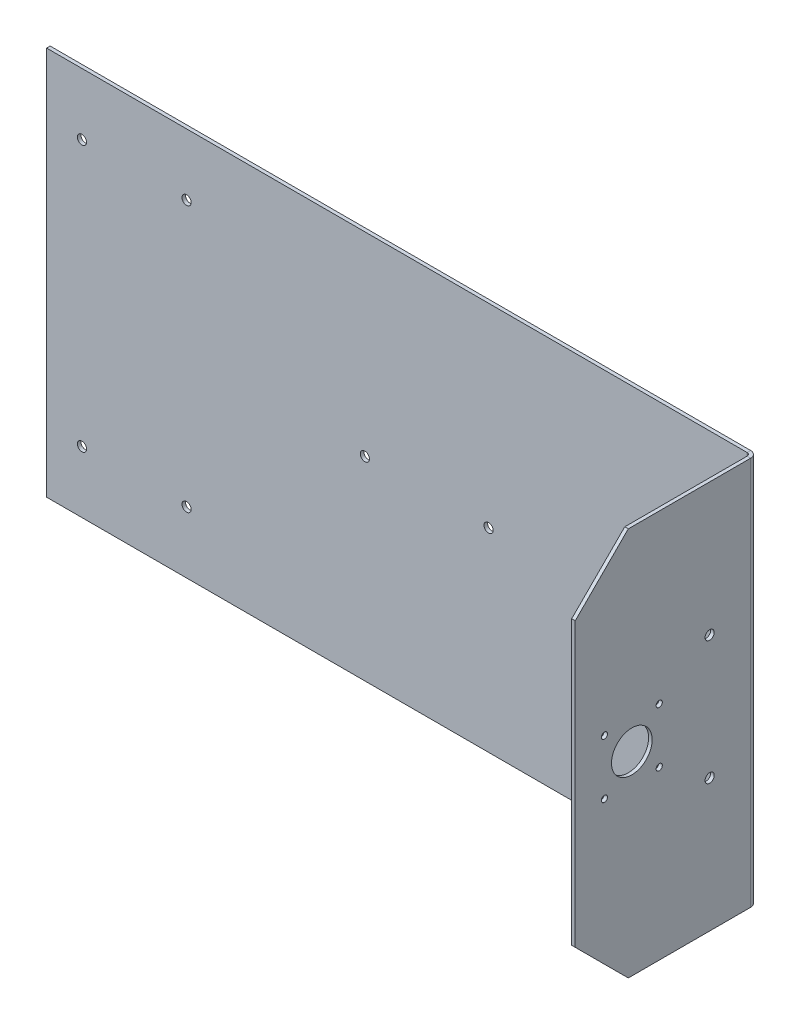
ISO-10303-21;
HEADER;
FILE_DESCRIPTION(('STEP AP214'),'2;1');
FILE_NAME('part.step','',(''),(''),'','','');
FILE_SCHEMA(('AUTOMOTIVE_DESIGN { 1 0 10303 214 1 1 1 1 }'));
ENDSEC;
DATA;
#1=APPLICATION_CONTEXT('core data for automotive mechanical design processes');
#2=APPLICATION_PROTOCOL_DEFINITION('international standard','automotive_design',2000,#1);
#3=PRODUCT_CONTEXT('',#1,'mechanical');
#4=PRODUCT('Part','Part','',(#3));
#5=PRODUCT_RELATED_PRODUCT_CATEGORY('part','',(#4));
#6=PRODUCT_DEFINITION_FORMATION('','',#4);
#7=PRODUCT_DEFINITION_CONTEXT('part definition',#1,'design');
#8=PRODUCT_DEFINITION('design','',#6,#7);
#9=PRODUCT_DEFINITION_SHAPE('','',#8);
#10=(LENGTH_UNIT() NAMED_UNIT(*) SI_UNIT(.MILLI.,.METRE.));
#11=(NAMED_UNIT(*) PLANE_ANGLE_UNIT() SI_UNIT($,.RADIAN.));
#12=(NAMED_UNIT(*) SI_UNIT($,.STERADIAN.) SOLID_ANGLE_UNIT());
#13=UNCERTAINTY_MEASURE_WITH_UNIT(LENGTH_MEASURE(1.E-05),#10,'distance_accuracy_value','');
#14=(GEOMETRIC_REPRESENTATION_CONTEXT(3) GLOBAL_UNCERTAINTY_ASSIGNED_CONTEXT((#13)) GLOBAL_UNIT_ASSIGNED_CONTEXT((#10,
#11,#12)) REPRESENTATION_CONTEXT('',''));
#15=CARTESIAN_POINT('',(0.,0.,0.));
#16=DIRECTION('',(0.,0.,1.));
#17=DIRECTION('',(1.,0.,0.));
#18=AXIS2_PLACEMENT_3D('',#15,#16,#17);
#19=CARTESIAN_POINT('',(200.,110.,3.));
#20=DIRECTION('',(0.,1.,0.));
#21=DIRECTION('',(0.,0.,-1.));
#22=AXIS2_PLACEMENT_3D('',#19,#20,#21);
#23=PLANE('',#22);
#24=DIRECTION('',(0.,0.,1.));
#25=VECTOR('',#24,1.);
#26=CARTESIAN_POINT('',(198.,110.,3.));
#27=LINE('',#26,#25);
#28=CARTESIAN_POINT('',(198.,110.,73.));
#29=VERTEX_POINT('',#28);
#30=CARTESIAN_POINT('',(198.,110.,3.8));
#31=VERTEX_POINT('',#30);
#32=EDGE_CURVE('E209',#29,#31,#27,.F.);
#33=ORIENTED_EDGE('',*,*,#32,.F.);
#34=DIRECTION('',(1.,0.,0.));
#35=VECTOR('',#34,1.);
#36=CARTESIAN_POINT('',(200.,110.,73.));
#37=LINE('',#36,#35);
#38=CARTESIAN_POINT('',(200.,110.,73.));
#39=VERTEX_POINT('',#38);
#40=EDGE_CURVE('E236',#29,#39,#37,.T.);
#41=ORIENTED_EDGE('',*,*,#40,.T.);
#42=DIRECTION('',(0.,0.,-1.));
#43=VECTOR('',#42,1.);
#44=CARTESIAN_POINT('',(200.,110.,3.));
#45=LINE('',#44,#43);
#46=CARTESIAN_POINT('',(200.,110.,3.8));
#47=VERTEX_POINT('',#46);
#48=EDGE_CURVE('E278',#39,#47,#45,.T.);
#49=ORIENTED_EDGE('',*,*,#48,.T.);
#50=DIRECTION('',(1.,0.,0.));
#51=VECTOR('',#50,1.);
#52=CARTESIAN_POINT('',(200.,110.,3.8));
#53=LINE('',#52,#51);
#54=EDGE_CURVE('E233',#31,#47,#53,.T.);
#55=ORIENTED_EDGE('',*,*,#54,.F.);
#56=EDGE_LOOP('',(#33,#41,#49,#55));
#57=FACE_BOUND('',#56,.T.);
#58=ADVANCED_FACE('F45',(#57),#23,.T.);
#59=CARTESIAN_POINT('',(200.,-110.,103.));
#60=DIRECTION('',(0.,0.,1.));
#61=DIRECTION('',(0.,1.,0.));
#62=AXIS2_PLACEMENT_3D('',#59,#60,#61);
#63=PLANE('',#62);
#64=DIRECTION('',(0.,1.,0.));
#65=VECTOR('',#64,1.);
#66=CARTESIAN_POINT('',(200.,-110.,103.));
#67=LINE('',#66,#65);
#68=CARTESIAN_POINT('',(200.,-80.0000000000001,103.));
#69=VERTEX_POINT('',#68);
#70=CARTESIAN_POINT('',(200.,79.9999999999999,103.));
#71=VERTEX_POINT('',#70);
#72=EDGE_CURVE('E280',#69,#71,#67,.T.);
#73=ORIENTED_EDGE('',*,*,#72,.T.);
#74=DIRECTION('',(-1.,0.,0.));
#75=VECTOR('',#74,1.);
#76=CARTESIAN_POINT('',(200.,79.9999999999999,103.));
#77=LINE('',#76,#75);
#78=CARTESIAN_POINT('',(198.,79.9999999999999,103.));
#79=VERTEX_POINT('',#78);
#80=EDGE_CURVE('E69',#71,#79,#77,.T.);
#81=ORIENTED_EDGE('',*,*,#80,.T.);
#82=DIRECTION('',(0.,1.,0.));
#83=VECTOR('',#82,1.);
#84=CARTESIAN_POINT('',(198.,-110.,103.));
#85=LINE('',#84,#83);
#86=CARTESIAN_POINT('',(198.,-80.0000000000001,103.));
#87=VERTEX_POINT('',#86);
#88=EDGE_CURVE('E207',#87,#79,#85,.T.);
#89=ORIENTED_EDGE('',*,*,#88,.F.);
#90=DIRECTION('',(1.,0.,0.));
#91=VECTOR('',#90,1.);
#92=CARTESIAN_POINT('',(200.,-80.0000000000001,103.));
#93=LINE('',#92,#91);
#94=EDGE_CURVE('E244',#87,#69,#93,.T.);
#95=ORIENTED_EDGE('',*,*,#94,.T.);
#96=EDGE_LOOP('',(#73,#81,#89,#95));
#97=FACE_BOUND('',#96,.T.);
#98=ADVANCED_FACE('F325',(#97),#63,.T.);
#99=CARTESIAN_POINT('',(200.,-110.,3.));
#100=DIRECTION('',(0.,1.,0.));
#101=DIRECTION('',(0.,0.,-1.));
#102=AXIS2_PLACEMENT_3D('',#99,#100,#101);
#103=PLANE('',#102);
#104=DIRECTION('',(0.,0.,-1.));
#105=VECTOR('',#104,1.);
#106=CARTESIAN_POINT('',(200.,-110.,3.));
#107=LINE('',#106,#105);
#108=CARTESIAN_POINT('',(200.,-110.,73.));
#109=VERTEX_POINT('',#108);
#110=CARTESIAN_POINT('',(200.,-110.,3.8));
#111=VERTEX_POINT('',#110);
#112=EDGE_CURVE('E282',#109,#111,#107,.T.);
#113=ORIENTED_EDGE('',*,*,#112,.F.);
#114=DIRECTION('',(1.,0.,0.));
#115=VECTOR('',#114,1.);
#116=CARTESIAN_POINT('',(200.,-110.,73.));
#117=LINE('',#116,#115);
#118=CARTESIAN_POINT('',(198.,-110.,73.));
#119=VERTEX_POINT('',#118);
#120=EDGE_CURVE('E11',#109,#119,#117,.F.);
#121=ORIENTED_EDGE('',*,*,#120,.T.);
#122=DIRECTION('',(0.,0.,1.));
#123=VECTOR('',#122,1.);
#124=CARTESIAN_POINT('',(198.,-110.,3.));
#125=LINE('',#124,#123);
#126=CARTESIAN_POINT('',(198.,-110.,3.8));
#127=VERTEX_POINT('',#126);
#128=EDGE_CURVE('E178',#119,#127,#125,.F.);
#129=ORIENTED_EDGE('',*,*,#128,.T.);
#130=DIRECTION('',(1.,0.,0.));
#131=VECTOR('',#130,1.);
#132=CARTESIAN_POINT('',(200.,-110.,3.8));
#133=LINE('',#132,#131);
#134=EDGE_CURVE('E230',#127,#111,#133,.T.);
#135=ORIENTED_EDGE('',*,*,#134,.T.);
#136=EDGE_LOOP('',(#113,#121,#129,#135));
#137=FACE_BOUND('',#136,.T.);
#138=ADVANCED_FACE('F331',(#137),#103,.F.);
#139=CARTESIAN_POINT('',(196.2,-110.,3.8));
#140=DIRECTION('',(0.,-1.,0.));
#141=DIRECTION('',(1.,0.,0.));
#142=AXIS2_PLACEMENT_3D('',#139,#140,#141);
#143=PLANE('',#142);
#144=ORIENTED_EDGE('',*,*,#134,.F.);
#145=CARTESIAN_POINT('',(196.2,-110.,3.8));
#146=DIRECTION('',(0.,1.,0.));
#147=DIRECTION('',(0.,0.,1.));
#148=AXIS2_PLACEMENT_3D('',#145,#146,#147);
#149=CIRCLE('',#148,1.8);
#150=CARTESIAN_POINT('',(196.2,-110.,2.));
#151=VERTEX_POINT('',#150);
#152=EDGE_CURVE('E201',#127,#151,#149,.T.);
#153=ORIENTED_EDGE('',*,*,#152,.T.);
#154=DIRECTION('',(0.,0.,-1.));
#155=VECTOR('',#154,1.);
#156=CARTESIAN_POINT('',(196.2,-110.,0.));
#157=LINE('',#156,#155);
#158=CARTESIAN_POINT('',(196.2,-110.,0.));
#159=VERTEX_POINT('',#158);
#160=EDGE_CURVE('E228',#151,#159,#157,.T.);
#161=ORIENTED_EDGE('',*,*,#160,.T.);
#162=CARTESIAN_POINT('',(196.2,-110.,3.8));
#163=DIRECTION('',(0.,1.,0.));
#164=DIRECTION('',(-1.,0.,0.));
#165=AXIS2_PLACEMENT_3D('',#162,#163,#164);
#166=CIRCLE('',#165,3.8);
#167=EDGE_CURVE('E163',#111,#159,#166,.T.);
#168=ORIENTED_EDGE('',*,*,#167,.F.);
#169=EDGE_LOOP('',(#144,#153,#161,#168));
#170=FACE_BOUND('',#169,.T.);
#171=ADVANCED_FACE('F387',(#170),#143,.T.);
#172=CARTESIAN_POINT('',(200.,-110.,0.));
#173=DIRECTION('',(0.,-1.,0.));
#174=DIRECTION('',(1.,0.,0.));
#175=AXIS2_PLACEMENT_3D('',#172,#173,#174);
#176=PLANE('',#175);
#177=ORIENTED_EDGE('',*,*,#160,.F.);
#178=DIRECTION('',(1.,0.,0.));
#179=VECTOR('',#178,1.);
#180=CARTESIAN_POINT('',(0.,-110.,2.));
#181=LINE('',#180,#179);
#182=CARTESIAN_POINT('',(-200.,-110.,2.));
#183=VERTEX_POINT('',#182);
#184=EDGE_CURVE('E173',#183,#151,#181,.T.);
#185=ORIENTED_EDGE('',*,*,#184,.F.);
#186=DIRECTION('',(0.,0.,-1.));
#187=VECTOR('',#186,1.);
#188=CARTESIAN_POINT('',(-200.,-110.,0.));
#189=LINE('',#188,#187);
#190=CARTESIAN_POINT('',(-200.,-110.,0.));
#191=VERTEX_POINT('',#190);
#192=EDGE_CURVE('E137',#183,#191,#189,.T.);
#193=ORIENTED_EDGE('',*,*,#192,.T.);
#194=DIRECTION('',(1.,0.,0.));
#195=VECTOR('',#194,1.);
#196=CARTESIAN_POINT('',(200.,-110.,0.));
#197=LINE('',#196,#195);
#198=EDGE_CURVE('E147',#191,#159,#197,.T.);
#199=ORIENTED_EDGE('',*,*,#198,.T.);
#200=EDGE_LOOP('',(#177,#185,#193,#199));
#201=FACE_BOUND('',#200,.T.);
#202=ADVANCED_FACE('F396',(#201),#176,.T.);
#203=CARTESIAN_POINT('',(-200.,-110.,0.));
#204=DIRECTION('',(-1.,0.,0.));
#205=DIRECTION('',(0.,-1.,0.));
#206=AXIS2_PLACEMENT_3D('',#203,#204,#205);
#207=PLANE('',#206);
#208=ORIENTED_EDGE('',*,*,#192,.F.);
#209=DIRECTION('',(0.,1.,0.));
#210=VECTOR('',#209,1.);
#211=CARTESIAN_POINT('',(-200.,0.,2.));
#212=LINE('',#211,#210);
#213=CARTESIAN_POINT('',(-200.,110.,2.));
#214=VERTEX_POINT('',#213);
#215=EDGE_CURVE('E132',#214,#183,#212,.F.);
#216=ORIENTED_EDGE('',*,*,#215,.F.);
#217=DIRECTION('',(0.,0.,-1.));
#218=VECTOR('',#217,1.);
#219=CARTESIAN_POINT('',(-200.,110.,0.));
#220=LINE('',#219,#218);
#221=CARTESIAN_POINT('',(-200.,110.,0.));
#222=VERTEX_POINT('',#221);
#223=EDGE_CURVE('E126',#214,#222,#220,.T.);
#224=ORIENTED_EDGE('',*,*,#223,.T.);
#225=DIRECTION('',(0.,-1.,0.));
#226=VECTOR('',#225,1.);
#227=CARTESIAN_POINT('',(-200.,-110.,0.));
#228=LINE('',#227,#226);
#229=EDGE_CURVE('E129',#222,#191,#228,.T.);
#230=ORIENTED_EDGE('',*,*,#229,.T.);
#231=EDGE_LOOP('',(#208,#216,#224,#230));
#232=FACE_BOUND('',#231,.T.);
#233=ADVANCED_FACE('F128',(#232),#207,.T.);
#234=CARTESIAN_POINT('',(200.,110.,0.));
#235=DIRECTION('',(0.,1.,0.));
#236=DIRECTION('',(-1.,0.,0.));
#237=AXIS2_PLACEMENT_3D('',#234,#235,#236);
#238=PLANE('',#237);
#239=ORIENTED_EDGE('',*,*,#223,.F.);
#240=DIRECTION('',(1.,0.,0.));
#241=VECTOR('',#240,1.);
#242=CARTESIAN_POINT('',(0.,110.,2.));
#243=LINE('',#242,#241);
#244=CARTESIAN_POINT('',(196.2,110.,2.));
#245=VERTEX_POINT('',#244);
#246=EDGE_CURVE('E196',#245,#214,#243,.F.);
#247=ORIENTED_EDGE('',*,*,#246,.F.);
#248=DIRECTION('',(0.,0.,-1.));
#249=VECTOR('',#248,1.);
#250=CARTESIAN_POINT('',(196.2,110.,0.));
#251=LINE('',#250,#249);
#252=CARTESIAN_POINT('',(196.2,110.,0.));
#253=VERTEX_POINT('',#252);
#254=EDGE_CURVE('E138',#245,#253,#251,.T.);
#255=ORIENTED_EDGE('',*,*,#254,.T.);
#256=DIRECTION('',(-1.,0.,0.));
#257=VECTOR('',#256,1.);
#258=CARTESIAN_POINT('',(200.,110.,0.));
#259=LINE('',#258,#257);
#260=EDGE_CURVE('E144',#253,#222,#259,.T.);
#261=ORIENTED_EDGE('',*,*,#260,.T.);
#262=EDGE_LOOP('',(#239,#247,#255,#261));
#263=FACE_BOUND('',#262,.T.);
#264=ADVANCED_FACE('F150',(#263),#238,.T.);
#265=CARTESIAN_POINT('',(200.,15.5,86.5));
#266=DIRECTION('',(-1.,0.,0.));
#267=DIRECTION('',(0.,0.,1.));
#268=AXIS2_PLACEMENT_3D('',#265,#266,#267);
#269=CYLINDRICAL_SURFACE('',#268,1.75);
#270=CARTESIAN_POINT('',(200.,15.5,86.5));
#271=DIRECTION('',(1.,0.,0.));
#272=DIRECTION('',(0.,1.,0.));
#273=AXIS2_PLACEMENT_3D('',#270,#271,#272);
#274=CIRCLE('',#273,1.75);
#275=CARTESIAN_POINT('',(200.,17.25,86.5));
#276=VERTEX_POINT('',#275);
#277=EDGE_CURVE('E167',#276,#276,#274,.T.);
#278=ORIENTED_EDGE('',*,*,#277,.T.);
#279=EDGE_LOOP('',(#278));
#280=FACE_BOUND('',#279,.T.);
#281=CARTESIAN_POINT('',(198.,15.5,86.5));
#282=DIRECTION('',(1.,0.,0.));
#283=DIRECTION('',(0.,1.,0.));
#284=AXIS2_PLACEMENT_3D('',#281,#282,#283);
#285=CIRCLE('',#284,1.75);
#286=CARTESIAN_POINT('',(198.,17.25,86.5));
#287=VERTEX_POINT('',#286);
#288=EDGE_CURVE('E204',#287,#287,#285,.T.);
#289=ORIENTED_EDGE('',*,*,#288,.F.);
#290=EDGE_LOOP('',(#289));
#291=FACE_BOUND('',#290,.T.);
#292=ADVANCED_FACE('F336',(#280,#291),#269,.F.);
#293=CARTESIAN_POINT('',(200.,-15.5,86.5));
#294=DIRECTION('',(-1.,0.,0.));
#295=DIRECTION('',(0.,0.,1.));
#296=AXIS2_PLACEMENT_3D('',#293,#294,#295);
#297=CYLINDRICAL_SURFACE('',#296,1.75);
#298=CARTESIAN_POINT('',(200.,-15.5,86.5));
#299=DIRECTION('',(1.,0.,0.));
#300=DIRECTION('',(0.,1.,0.));
#301=AXIS2_PLACEMENT_3D('',#298,#299,#300);
#302=CIRCLE('',#301,1.75);
#303=CARTESIAN_POINT('',(200.,-13.75,86.5));
#304=VERTEX_POINT('',#303);
#305=EDGE_CURVE('E266',#304,#304,#302,.T.);
#306=ORIENTED_EDGE('',*,*,#305,.T.);
#307=EDGE_LOOP('',(#306));
#308=FACE_BOUND('',#307,.T.);
#309=CARTESIAN_POINT('',(198.,-15.5,86.5));
#310=DIRECTION('',(1.,0.,0.));
#311=DIRECTION('',(0.,1.,0.));
#312=AXIS2_PLACEMENT_3D('',#309,#310,#311);
#313=CIRCLE('',#312,1.75);
#314=CARTESIAN_POINT('',(198.,-13.75,86.5));
#315=VERTEX_POINT('',#314);
#316=EDGE_CURVE('E216',#315,#315,#313,.T.);
#317=ORIENTED_EDGE('',*,*,#316,.F.);
#318=EDGE_LOOP('',(#317));
#319=FACE_BOUND('',#318,.T.);
#320=ADVANCED_FACE('F339',(#308,#319),#297,.F.);
#321=CARTESIAN_POINT('',(200.,-15.5,55.5));
#322=DIRECTION('',(-1.,0.,0.));
#323=DIRECTION('',(0.,0.,1.));
#324=AXIS2_PLACEMENT_3D('',#321,#322,#323);
#325=CYLINDRICAL_SURFACE('',#324,1.75);
#326=CARTESIAN_POINT('',(200.,-15.5,55.5));
#327=DIRECTION('',(1.,0.,0.));
#328=DIRECTION('',(0.,1.,0.));
#329=AXIS2_PLACEMENT_3D('',#326,#327,#328);
#330=CIRCLE('',#329,1.75);
#331=CARTESIAN_POINT('',(200.,-13.75,55.5));
#332=VERTEX_POINT('',#331);
#333=EDGE_CURVE('E269',#332,#332,#330,.T.);
#334=ORIENTED_EDGE('',*,*,#333,.T.);
#335=EDGE_LOOP('',(#334));
#336=FACE_BOUND('',#335,.T.);
#337=CARTESIAN_POINT('',(198.,-15.5,55.5));
#338=DIRECTION('',(1.,0.,0.));
#339=DIRECTION('',(0.,1.,0.));
#340=AXIS2_PLACEMENT_3D('',#337,#338,#339);
#341=CIRCLE('',#340,1.75);
#342=CARTESIAN_POINT('',(198.,-13.75,55.5));
#343=VERTEX_POINT('',#342);
#344=EDGE_CURVE('E219',#343,#343,#341,.T.);
#345=ORIENTED_EDGE('',*,*,#344,.F.);
#346=EDGE_LOOP('',(#345));
#347=FACE_BOUND('',#346,.T.);
#348=ADVANCED_FACE('F343',(#336,#347),#325,.F.);
#349=CARTESIAN_POINT('',(200.,15.5,55.5));
#350=DIRECTION('',(-1.,0.,0.));
#351=DIRECTION('',(0.,0.,1.));
#352=AXIS2_PLACEMENT_3D('',#349,#350,#351);
#353=CYLINDRICAL_SURFACE('',#352,1.75);
#354=CARTESIAN_POINT('',(200.,15.5,55.5));
#355=DIRECTION('',(1.,0.,0.));
#356=DIRECTION('',(0.,1.,0.));
#357=AXIS2_PLACEMENT_3D('',#354,#355,#356);
#358=CIRCLE('',#357,1.75);
#359=CARTESIAN_POINT('',(200.,17.25,55.5));
#360=VERTEX_POINT('',#359);
#361=EDGE_CURVE('E272',#360,#360,#358,.T.);
#362=ORIENTED_EDGE('',*,*,#361,.T.);
#363=EDGE_LOOP('',(#362));
#364=FACE_BOUND('',#363,.T.);
#365=CARTESIAN_POINT('',(198.,15.5,55.5));
#366=DIRECTION('',(1.,0.,0.));
#367=DIRECTION('',(0.,1.,0.));
#368=AXIS2_PLACEMENT_3D('',#365,#366,#367);
#369=CIRCLE('',#368,1.75);
#370=CARTESIAN_POINT('',(198.,17.25,55.5));
#371=VERTEX_POINT('',#370);
#372=EDGE_CURVE('E222',#371,#371,#369,.T.);
#373=ORIENTED_EDGE('',*,*,#372,.F.);
#374=EDGE_LOOP('',(#373));
#375=FACE_BOUND('',#374,.T.);
#376=ADVANCED_FACE('F347',(#364,#375),#353,.F.);
#377=CARTESIAN_POINT('',(200.,0.,71.));
#378=DIRECTION('',(-1.,0.,0.));
#379=DIRECTION('',(0.,0.,1.));
#380=AXIS2_PLACEMENT_3D('',#377,#378,#379);
#381=CYLINDRICAL_SURFACE('',#380,11.5);
#382=CARTESIAN_POINT('',(200.,0.,71.));
#383=DIRECTION('',(1.,0.,0.));
#384=DIRECTION('',(0.,1.,0.));
#385=AXIS2_PLACEMENT_3D('',#382,#383,#384);
#386=CIRCLE('',#385,11.5);
#387=CARTESIAN_POINT('',(200.,11.5,71.));
#388=VERTEX_POINT('',#387);
#389=EDGE_CURVE('E275',#388,#388,#386,.T.);
#390=ORIENTED_EDGE('',*,*,#389,.T.);
#391=EDGE_LOOP('',(#390));
#392=FACE_BOUND('',#391,.T.);
#393=CARTESIAN_POINT('',(198.,0.,71.));
#394=DIRECTION('',(1.,0.,0.));
#395=DIRECTION('',(0.,1.,0.));
#396=AXIS2_PLACEMENT_3D('',#393,#394,#395);
#397=CIRCLE('',#396,11.5);
#398=CARTESIAN_POINT('',(198.,11.5,71.));
#399=VERTEX_POINT('',#398);
#400=EDGE_CURVE('E211',#399,#399,#397,.T.);
#401=ORIENTED_EDGE('',*,*,#400,.F.);
#402=EDGE_LOOP('',(#401));
#403=FACE_BOUND('',#402,.T.);
#404=ADVANCED_FACE('F351',(#392,#403),#381,.F.);
#405=CARTESIAN_POINT('',(-180.,75.1360607616786,0.));
#406=DIRECTION('',(0.,0.,1.));
#407=DIRECTION('',(1.,0.,0.));
#408=AXIS2_PLACEMENT_3D('',#405,#406,#407);
#409=CYLINDRICAL_SURFACE('',#408,2.59999999999999);
#410=CARTESIAN_POINT('',(-180.,75.1360607616786,0.));
#411=DIRECTION('',(0.,0.,-1.));
#412=DIRECTION('',(-1.,0.,0.));
#413=AXIS2_PLACEMENT_3D('',#410,#411,#412);
#414=CIRCLE('',#413,2.59999999999999);
#415=CARTESIAN_POINT('',(-182.6,75.1360607616786,0.));
#416=VERTEX_POINT('',#415);
#417=EDGE_CURVE('E284',#416,#416,#414,.T.);
#418=ORIENTED_EDGE('',*,*,#417,.T.);
#419=EDGE_LOOP('',(#418));
#420=FACE_BOUND('',#419,.T.);
#421=CARTESIAN_POINT('',(-180.,75.1360607616786,2.));
#422=DIRECTION('',(0.,0.,-1.));
#423=DIRECTION('',(-1.,0.,0.));
#424=AXIS2_PLACEMENT_3D('',#421,#422,#423);
#425=CIRCLE('',#424,2.59999999999999);
#426=CARTESIAN_POINT('',(-182.6,75.1360607616786,2.));
#427=VERTEX_POINT('',#426);
#428=EDGE_CURVE('E174',#427,#427,#425,.T.);
#429=ORIENTED_EDGE('',*,*,#428,.F.);
#430=EDGE_LOOP('',(#429));
#431=FACE_BOUND('',#430,.T.);
#432=ADVANCED_FACE('F354',(#420,#431),#409,.F.);
#433=CARTESIAN_POINT('',(-120.816364570071,-75.1360607616786,0.));
#434=DIRECTION('',(0.,0.,1.));
#435=DIRECTION('',(1.,0.,0.));
#436=AXIS2_PLACEMENT_3D('',#433,#434,#435);
#437=CYLINDRICAL_SURFACE('',#436,2.6);
#438=CARTESIAN_POINT('',(-120.816364570071,-75.1360607616786,0.));
#439=DIRECTION('',(0.,0.,-1.));
#440=DIRECTION('',(-1.,0.,0.));
#441=AXIS2_PLACEMENT_3D('',#438,#439,#440);
#442=CIRCLE('',#441,2.6);
#443=CARTESIAN_POINT('',(-123.416364570071,-75.1360607616786,0.));
#444=VERTEX_POINT('',#443);
#445=EDGE_CURVE('E287',#444,#444,#442,.T.);
#446=ORIENTED_EDGE('',*,*,#445,.T.);
#447=EDGE_LOOP('',(#446));
#448=FACE_BOUND('',#447,.T.);
#449=CARTESIAN_POINT('',(-120.816364570071,-75.1360607616786,2.));
#450=DIRECTION('',(0.,0.,-1.));
#451=DIRECTION('',(-1.,0.,0.));
#452=AXIS2_PLACEMENT_3D('',#449,#450,#451);
#453=CIRCLE('',#452,2.6);
#454=CARTESIAN_POINT('',(-123.416364570071,-75.1360607616786,2.));
#455=VERTEX_POINT('',#454);
#456=EDGE_CURVE('E177',#455,#455,#453,.T.);
#457=ORIENTED_EDGE('',*,*,#456,.F.);
#458=EDGE_LOOP('',(#457));
#459=FACE_BOUND('',#458,.T.);
#460=ADVANCED_FACE('F480',(#448,#459),#437,.F.);
#461=CARTESIAN_POINT('',(120.,0.,0.));
#462=DIRECTION('',(0.,0.,1.));
#463=DIRECTION('',(1.,0.,0.));
#464=AXIS2_PLACEMENT_3D('',#461,#462,#463);
#465=CYLINDRICAL_SURFACE('',#464,2.6);
#466=CARTESIAN_POINT('',(120.,0.,0.));
#467=DIRECTION('',(0.,0.,-1.));
#468=DIRECTION('',(-1.,0.,0.));
#469=AXIS2_PLACEMENT_3D('',#466,#467,#468);
#470=CIRCLE('',#469,2.6);
#471=CARTESIAN_POINT('',(117.4,0.,0.));
#472=VERTEX_POINT('',#471);
#473=EDGE_CURVE('E290',#472,#472,#470,.T.);
#474=ORIENTED_EDGE('',*,*,#473,.T.);
#475=EDGE_LOOP('',(#474));
#476=FACE_BOUND('',#475,.T.);
#477=CARTESIAN_POINT('',(120.,0.,2.));
#478=DIRECTION('',(0.,0.,-1.));
#479=DIRECTION('',(-1.,0.,0.));
#480=AXIS2_PLACEMENT_3D('',#477,#478,#479);
#481=CIRCLE('',#480,2.6);
#482=CARTESIAN_POINT('',(117.4,0.,2.));
#483=VERTEX_POINT('',#482);
#484=EDGE_CURVE('E181',#483,#483,#481,.T.);
#485=ORIENTED_EDGE('',*,*,#484,.F.);
#486=EDGE_LOOP('',(#485));
#487=FACE_BOUND('',#486,.T.);
#488=ADVANCED_FACE('F491',(#476,#487),#465,.F.);
#489=CARTESIAN_POINT('',(50.0000000000001,0.,0.));
#490=DIRECTION('',(0.,0.,1.));
#491=DIRECTION('',(1.,0.,0.));
#492=AXIS2_PLACEMENT_3D('',#489,#490,#491);
#493=CYLINDRICAL_SURFACE('',#492,2.6);
#494=CARTESIAN_POINT('',(50.0000000000001,0.,0.));
#495=DIRECTION('',(0.,0.,-1.));
#496=DIRECTION('',(-1.,0.,0.));
#497=AXIS2_PLACEMENT_3D('',#494,#495,#496);
#498=CIRCLE('',#497,2.6);
#499=CARTESIAN_POINT('',(47.4000000000001,0.,0.));
#500=VERTEX_POINT('',#499);
#501=EDGE_CURVE('E293',#500,#500,#498,.T.);
#502=ORIENTED_EDGE('',*,*,#501,.T.);
#503=EDGE_LOOP('',(#502));
#504=FACE_BOUND('',#503,.T.);
#505=CARTESIAN_POINT('',(50.0000000000001,0.,2.));
#506=DIRECTION('',(0.,0.,-1.));
#507=DIRECTION('',(-1.,0.,0.));
#508=AXIS2_PLACEMENT_3D('',#505,#506,#507);
#509=CIRCLE('',#508,2.6);
#510=CARTESIAN_POINT('',(47.4000000000001,0.,2.));
#511=VERTEX_POINT('',#510);
#512=EDGE_CURVE('E184',#511,#511,#509,.T.);
#513=ORIENTED_EDGE('',*,*,#512,.F.);
#514=EDGE_LOOP('',(#513));
#515=FACE_BOUND('',#514,.T.);
#516=ADVANCED_FACE('F502',(#504,#515),#493,.F.);
#517=CARTESIAN_POINT('',(-20.,0.,0.));
#518=DIRECTION('',(0.,0.,1.));
#519=DIRECTION('',(1.,0.,0.));
#520=AXIS2_PLACEMENT_3D('',#517,#518,#519);
#521=CYLINDRICAL_SURFACE('',#520,2.6);
#522=CARTESIAN_POINT('',(-20.,0.,0.));
#523=DIRECTION('',(0.,0.,-1.));
#524=DIRECTION('',(-1.,0.,0.));
#525=AXIS2_PLACEMENT_3D('',#522,#523,#524);
#526=CIRCLE('',#525,2.6);
#527=CARTESIAN_POINT('',(-22.6,0.,0.));
#528=VERTEX_POINT('',#527);
#529=EDGE_CURVE('E296',#528,#528,#526,.T.);
#530=ORIENTED_EDGE('',*,*,#529,.T.);
#531=EDGE_LOOP('',(#530));
#532=FACE_BOUND('',#531,.T.);
#533=CARTESIAN_POINT('',(-20.,0.,2.));
#534=DIRECTION('',(0.,0.,-1.));
#535=DIRECTION('',(-1.,0.,0.));
#536=AXIS2_PLACEMENT_3D('',#533,#534,#535);
#537=CIRCLE('',#536,2.6);
#538=CARTESIAN_POINT('',(-22.6,0.,2.));
#539=VERTEX_POINT('',#538);
#540=EDGE_CURVE('E187',#539,#539,#537,.T.);
#541=ORIENTED_EDGE('',*,*,#540,.F.);
#542=EDGE_LOOP('',(#541));
#543=FACE_BOUND('',#542,.T.);
#544=ADVANCED_FACE('F513',(#532,#543),#521,.F.);
#545=CARTESIAN_POINT('',(-120.816364570071,75.1360607616786,0.));
#546=DIRECTION('',(0.,0.,1.));
#547=DIRECTION('',(1.,0.,0.));
#548=AXIS2_PLACEMENT_3D('',#545,#546,#547);
#549=CYLINDRICAL_SURFACE('',#548,2.6);
#550=CARTESIAN_POINT('',(-120.816364570071,75.1360607616786,0.));
#551=DIRECTION('',(0.,0.,-1.));
#552=DIRECTION('',(1.,0.,0.));
#553=AXIS2_PLACEMENT_3D('',#550,#551,#552);
#554=CIRCLE('',#553,2.6);
#555=CARTESIAN_POINT('',(-118.216364570071,75.1360607616786,0.));
#556=VERTEX_POINT('',#555);
#557=EDGE_CURVE('E299',#556,#556,#554,.T.);
#558=ORIENTED_EDGE('',*,*,#557,.T.);
#559=EDGE_LOOP('',(#558));
#560=FACE_BOUND('',#559,.T.);
#561=CARTESIAN_POINT('',(-120.816364570071,75.1360607616786,2.));
#562=DIRECTION('',(0.,0.,-1.));
#563=DIRECTION('',(-1.,0.,0.));
#564=AXIS2_PLACEMENT_3D('',#561,#562,#563);
#565=CIRCLE('',#564,2.6);
#566=CARTESIAN_POINT('',(-123.416364570071,75.1360607616786,2.));
#567=VERTEX_POINT('',#566);
#568=EDGE_CURVE('E190',#567,#567,#565,.T.);
#569=ORIENTED_EDGE('',*,*,#568,.F.);
#570=EDGE_LOOP('',(#569));
#571=FACE_BOUND('',#570,.T.);
#572=ADVANCED_FACE('F524',(#560,#571),#549,.F.);
#573=CARTESIAN_POINT('',(-180.,-75.1360607616786,0.));
#574=DIRECTION('',(0.,0.,1.));
#575=DIRECTION('',(1.,0.,0.));
#576=AXIS2_PLACEMENT_3D('',#573,#574,#575);
#577=CYLINDRICAL_SURFACE('',#576,2.59999999999999);
#578=CARTESIAN_POINT('',(-180.,-75.1360607616786,0.));
#579=DIRECTION('',(0.,0.,-1.));
#580=DIRECTION('',(-1.,0.,0.));
#581=AXIS2_PLACEMENT_3D('',#578,#579,#580);
#582=CIRCLE('',#581,2.59999999999999);
#583=CARTESIAN_POINT('',(-182.6,-75.1360607616786,0.));
#584=VERTEX_POINT('',#583);
#585=EDGE_CURVE('E148',#584,#584,#582,.T.);
#586=ORIENTED_EDGE('',*,*,#585,.T.);
#587=EDGE_LOOP('',(#586));
#588=FACE_BOUND('',#587,.T.);
#589=CARTESIAN_POINT('',(-180.,-75.1360607616786,2.));
#590=DIRECTION('',(0.,0.,-1.));
#591=DIRECTION('',(-1.,0.,0.));
#592=AXIS2_PLACEMENT_3D('',#589,#590,#591);
#593=CIRCLE('',#592,2.59999999999999);
#594=CARTESIAN_POINT('',(-182.6,-75.1360607616786,2.));
#595=VERTEX_POINT('',#594);
#596=EDGE_CURVE('E193',#595,#595,#593,.T.);
#597=ORIENTED_EDGE('',*,*,#596,.F.);
#598=EDGE_LOOP('',(#597));
#599=FACE_BOUND('',#598,.T.);
#600=ADVANCED_FACE('F304',(#588,#599),#577,.F.);
#601=CARTESIAN_POINT('',(196.2,110.,3.8));
#602=DIRECTION('',(0.,-1.,0.));
#603=DIRECTION('',(1.,0.,0.));
#604=AXIS2_PLACEMENT_3D('',#601,#602,#603);
#605=PLANE('',#604);
#606=CARTESIAN_POINT('',(196.2,110.,3.8));
#607=DIRECTION('',(0.,1.,0.));
#608=DIRECTION('',(0.,0.,1.));
#609=AXIS2_PLACEMENT_3D('',#606,#607,#608);
#610=CIRCLE('',#609,1.8);
#611=EDGE_CURVE('E205',#245,#31,#610,.F.);
#612=ORIENTED_EDGE('',*,*,#611,.T.);
#613=ORIENTED_EDGE('',*,*,#54,.T.);
#614=CARTESIAN_POINT('',(196.2,110.,3.8));
#615=DIRECTION('',(0.,1.,0.));
#616=DIRECTION('',(-1.,0.,0.));
#617=AXIS2_PLACEMENT_3D('',#614,#615,#616);
#618=CIRCLE('',#617,3.8);
#619=EDGE_CURVE('E160',#253,#47,#618,.F.);
#620=ORIENTED_EDGE('',*,*,#619,.F.);
#621=ORIENTED_EDGE('',*,*,#254,.F.);
#622=EDGE_LOOP('',(#612,#613,#620,#621));
#623=FACE_BOUND('',#622,.T.);
#624=ADVANCED_FACE('F309',(#623),#605,.F.);
#625=CARTESIAN_POINT('',(0.,0.,0.));
#626=DIRECTION('',(0.,0.,1.));
#627=DIRECTION('',(1.,0.,0.));
#628=AXIS2_PLACEMENT_3D('',#625,#626,#627);
#629=PLANE('',#628);
#630=ORIENTED_EDGE('',*,*,#417,.F.);
#631=EDGE_LOOP('',(#630));
#632=FACE_BOUND('',#631,.T.);
#633=ORIENTED_EDGE('',*,*,#445,.F.);
#634=EDGE_LOOP('',(#633));
#635=FACE_BOUND('',#634,.T.);
#636=ORIENTED_EDGE('',*,*,#473,.F.);
#637=EDGE_LOOP('',(#636));
#638=FACE_BOUND('',#637,.T.);
#639=ORIENTED_EDGE('',*,*,#501,.F.);
#640=EDGE_LOOP('',(#639));
#641=FACE_BOUND('',#640,.T.);
#642=ORIENTED_EDGE('',*,*,#529,.F.);
#643=EDGE_LOOP('',(#642));
#644=FACE_BOUND('',#643,.T.);
#645=ORIENTED_EDGE('',*,*,#557,.F.);
#646=EDGE_LOOP('',(#645));
#647=FACE_BOUND('',#646,.T.);
#648=ORIENTED_EDGE('',*,*,#585,.F.);
#649=EDGE_LOOP('',(#648));
#650=FACE_BOUND('',#649,.T.);
#651=ORIENTED_EDGE('',*,*,#260,.F.);
#652=DIRECTION('',(0.,1.,0.));
#653=VECTOR('',#652,1.);
#654=CARTESIAN_POINT('',(196.2,0.,0.));
#655=LINE('',#654,#653);
#656=EDGE_CURVE('E158',#253,#159,#655,.F.);
#657=ORIENTED_EDGE('',*,*,#656,.T.);
#658=ORIENTED_EDGE('',*,*,#198,.F.);
#659=ORIENTED_EDGE('',*,*,#229,.F.);
#660=EDGE_LOOP('',(#651,#657,#658,#659));
#661=FACE_BOUND('',#660,.T.);
#662=ADVANCED_FACE('F142',(#632,#635,#638,#641,#644,#647,#650,#661),#629,.F.);
#663=CARTESIAN_POINT('',(200.,-110.,3.));
#664=DIRECTION('',(-1.,0.,0.));
#665=DIRECTION('',(0.,0.,1.));
#666=AXIS2_PLACEMENT_3D('',#663,#664,#665);
#667=PLANE('',#666);
#668=CARTESIAN_POINT('',(200.,-35.,27.));
#669=DIRECTION('',(1.,0.,0.));
#670=DIRECTION('',(0.,1.,0.));
#671=AXIS2_PLACEMENT_3D('',#668,#669,#670);
#672=CIRCLE('',#671,2.6);
#673=CARTESIAN_POINT('',(200.,-32.4,27.));
#674=VERTEX_POINT('',#673);
#675=EDGE_CURVE('E252',#674,#674,#672,.T.);
#676=ORIENTED_EDGE('',*,*,#675,.F.);
#677=EDGE_LOOP('',(#676));
#678=FACE_BOUND('',#677,.T.);
#679=CARTESIAN_POINT('',(200.,35.,27.));
#680=DIRECTION('',(1.,0.,0.));
#681=DIRECTION('',(0.,-1.,0.));
#682=AXIS2_PLACEMENT_3D('',#679,#680,#681);
#683=CIRCLE('',#682,2.6);
#684=CARTESIAN_POINT('',(200.,32.4,27.));
#685=VERTEX_POINT('',#684);
#686=EDGE_CURVE('E257',#685,#685,#683,.T.);
#687=ORIENTED_EDGE('',*,*,#686,.F.);
#688=EDGE_LOOP('',(#687));
#689=FACE_BOUND('',#688,.T.);
#690=ORIENTED_EDGE('',*,*,#277,.F.);
#691=EDGE_LOOP('',(#690));
#692=FACE_BOUND('',#691,.T.);
#693=ORIENTED_EDGE('',*,*,#305,.F.);
#694=EDGE_LOOP('',(#693));
#695=FACE_BOUND('',#694,.T.);
#696=ORIENTED_EDGE('',*,*,#333,.F.);
#697=EDGE_LOOP('',(#696));
#698=FACE_BOUND('',#697,.T.);
#699=ORIENTED_EDGE('',*,*,#361,.F.);
#700=EDGE_LOOP('',(#699));
#701=FACE_BOUND('',#700,.T.);
#702=ORIENTED_EDGE('',*,*,#389,.F.);
#703=EDGE_LOOP('',(#702));
#704=FACE_BOUND('',#703,.T.);
#705=ORIENTED_EDGE('',*,*,#48,.F.);
#706=DIRECTION('',(0.,0.70710678118655,-0.707106781186545));
#707=VECTOR('',#706,1.);
#708=CARTESIAN_POINT('',(200.,110.,73.));
#709=LINE('',#708,#707);
#710=EDGE_CURVE('E242',#39,#71,#709,.F.);
#711=ORIENTED_EDGE('',*,*,#710,.T.);
#712=ORIENTED_EDGE('',*,*,#72,.F.);
#713=DIRECTION('',(0.,-0.707106781186546,-0.707106781186549));
#714=VECTOR('',#713,1.);
#715=CARTESIAN_POINT('',(200.,-80.0000000000001,103.));
#716=LINE('',#715,#714);
#717=EDGE_CURVE('E240',#69,#109,#716,.T.);
#718=ORIENTED_EDGE('',*,*,#717,.T.);
#719=ORIENTED_EDGE('',*,*,#112,.T.);
#720=DIRECTION('',(0.,1.,0.));
#721=VECTOR('',#720,1.);
#722=CARTESIAN_POINT('',(200.,-110.,3.8));
#723=LINE('',#722,#721);
#724=EDGE_CURVE('E152',#111,#47,#723,.T.);
#725=ORIENTED_EDGE('',*,*,#724,.T.);
#726=EDGE_LOOP('',(#705,#711,#712,#718,#719,#725));
#727=FACE_BOUND('',#726,.T.);
#728=ADVANCED_FACE('F308',(#678,#689,#692,#695,#698,#701,#704,#727),#667,.F.);
#729=CARTESIAN_POINT('',(196.2,-110.,3.8));
#730=DIRECTION('',(0.,1.,0.));
#731=DIRECTION('',(0.,0.,1.));
#732=AXIS2_PLACEMENT_3D('',#729,#730,#731);
#733=CYLINDRICAL_SURFACE('',#732,3.8);
#734=ORIENTED_EDGE('',*,*,#167,.T.);
#735=ORIENTED_EDGE('',*,*,#656,.F.);
#736=ORIENTED_EDGE('',*,*,#619,.T.);
#737=ORIENTED_EDGE('',*,*,#724,.F.);
#738=EDGE_LOOP('',(#734,#735,#736,#737));
#739=FACE_BOUND('',#738,.T.);
#740=ADVANCED_FACE('F316',(#739),#733,.T.);
#741=CARTESIAN_POINT('',(0.,0.,2.));
#742=DIRECTION('',(0.,0.,1.));
#743=DIRECTION('',(1.,0.,0.));
#744=AXIS2_PLACEMENT_3D('',#741,#742,#743);
#745=PLANE('',#744);
#746=ORIENTED_EDGE('',*,*,#428,.T.);
#747=EDGE_LOOP('',(#746));
#748=FACE_BOUND('',#747,.T.);
#749=ORIENTED_EDGE('',*,*,#456,.T.);
#750=EDGE_LOOP('',(#749));
#751=FACE_BOUND('',#750,.T.);
#752=ORIENTED_EDGE('',*,*,#484,.T.);
#753=EDGE_LOOP('',(#752));
#754=FACE_BOUND('',#753,.T.);
#755=ORIENTED_EDGE('',*,*,#512,.T.);
#756=EDGE_LOOP('',(#755));
#757=FACE_BOUND('',#756,.T.);
#758=ORIENTED_EDGE('',*,*,#540,.T.);
#759=EDGE_LOOP('',(#758));
#760=FACE_BOUND('',#759,.T.);
#761=ORIENTED_EDGE('',*,*,#568,.T.);
#762=EDGE_LOOP('',(#761));
#763=FACE_BOUND('',#762,.T.);
#764=ORIENTED_EDGE('',*,*,#596,.T.);
#765=EDGE_LOOP('',(#764));
#766=FACE_BOUND('',#765,.T.);
#767=ORIENTED_EDGE('',*,*,#246,.T.);
#768=ORIENTED_EDGE('',*,*,#215,.T.);
#769=ORIENTED_EDGE('',*,*,#184,.T.);
#770=DIRECTION('',(0.,1.,0.));
#771=VECTOR('',#770,1.);
#772=CARTESIAN_POINT('',(196.2,0.,2.));
#773=LINE('',#772,#771);
#774=EDGE_CURVE('E164',#245,#151,#773,.F.);
#775=ORIENTED_EDGE('',*,*,#774,.F.);
#776=EDGE_LOOP('',(#767,#768,#769,#775));
#777=FACE_BOUND('',#776,.T.);
#778=ADVANCED_FACE('F383',(#748,#751,#754,#757,#760,#763,#766,#777),#745,.T.);
#779=CARTESIAN_POINT('',(198.,-110.,3.));
#780=DIRECTION('',(-1.,0.,0.));
#781=DIRECTION('',(0.,0.,1.));
#782=AXIS2_PLACEMENT_3D('',#779,#780,#781);
#783=PLANE('',#782);
#784=CARTESIAN_POINT('',(198.,-35.,27.));
#785=DIRECTION('',(-1.,0.,0.));
#786=DIRECTION('',(0.,0.,1.));
#787=AXIS2_PLACEMENT_3D('',#784,#785,#786);
#788=CIRCLE('',#787,2.6);
#789=CARTESIAN_POINT('',(198.,-35.,29.6));
#790=VERTEX_POINT('',#789);
#791=EDGE_CURVE('E50',#790,#790,#788,.T.);
#792=ORIENTED_EDGE('',*,*,#791,.F.);
#793=EDGE_LOOP('',(#792));
#794=FACE_BOUND('',#793,.T.);
#795=CARTESIAN_POINT('',(198.,35.,27.));
#796=DIRECTION('',(-1.,0.,0.));
#797=DIRECTION('',(0.,0.,1.));
#798=AXIS2_PLACEMENT_3D('',#795,#796,#797);
#799=CIRCLE('',#798,2.6);
#800=CARTESIAN_POINT('',(198.,35.,29.6));
#801=VERTEX_POINT('',#800);
#802=EDGE_CURVE('E250',#801,#801,#799,.T.);
#803=ORIENTED_EDGE('',*,*,#802,.F.);
#804=EDGE_LOOP('',(#803));
#805=FACE_BOUND('',#804,.T.);
#806=ORIENTED_EDGE('',*,*,#288,.T.);
#807=EDGE_LOOP('',(#806));
#808=FACE_BOUND('',#807,.T.);
#809=ORIENTED_EDGE('',*,*,#316,.T.);
#810=EDGE_LOOP('',(#809));
#811=FACE_BOUND('',#810,.T.);
#812=ORIENTED_EDGE('',*,*,#344,.T.);
#813=EDGE_LOOP('',(#812));
#814=FACE_BOUND('',#813,.T.);
#815=ORIENTED_EDGE('',*,*,#372,.T.);
#816=EDGE_LOOP('',(#815));
#817=FACE_BOUND('',#816,.T.);
#818=ORIENTED_EDGE('',*,*,#400,.T.);
#819=EDGE_LOOP('',(#818));
#820=FACE_BOUND('',#819,.T.);
#821=ORIENTED_EDGE('',*,*,#88,.T.);
#822=DIRECTION('',(0.,-0.70710678118655,0.707106781186545));
#823=VECTOR('',#822,1.);
#824=CARTESIAN_POINT('',(198.,34.9999999999994,148.));
#825=LINE('',#824,#823);
#826=EDGE_CURVE('E55',#79,#29,#825,.F.);
#827=ORIENTED_EDGE('',*,*,#826,.T.);
#828=ORIENTED_EDGE('',*,*,#32,.T.);
#829=DIRECTION('',(0.,1.,0.));
#830=VECTOR('',#829,1.);
#831=CARTESIAN_POINT('',(198.,-110.,3.8));
#832=LINE('',#831,#830);
#833=EDGE_CURVE('E170',#127,#31,#832,.T.);
#834=ORIENTED_EDGE('',*,*,#833,.F.);
#835=ORIENTED_EDGE('',*,*,#128,.F.);
#836=DIRECTION('',(0.,0.707106781186546,0.707106781186549));
#837=VECTOR('',#836,1.);
#838=CARTESIAN_POINT('',(198.,-145.,37.9999999999999));
#839=LINE('',#838,#837);
#840=EDGE_CURVE('E248',#119,#87,#839,.T.);
#841=ORIENTED_EDGE('',*,*,#840,.T.);
#842=EDGE_LOOP('',(#821,#827,#828,#834,#835,#841));
#843=FACE_BOUND('',#842,.T.);
#844=ADVANCED_FACE('F369',(#794,#805,#808,#811,#814,#817,#820,#843),#783,.T.);
#845=CARTESIAN_POINT('',(196.2,-110.,3.8));
#846=DIRECTION('',(0.,1.,0.));
#847=DIRECTION('',(0.,0.,1.));
#848=AXIS2_PLACEMENT_3D('',#845,#846,#847);
#849=CYLINDRICAL_SURFACE('',#848,1.8);
#850=ORIENTED_EDGE('',*,*,#152,.F.);
#851=ORIENTED_EDGE('',*,*,#833,.T.);
#852=ORIENTED_EDGE('',*,*,#611,.F.);
#853=ORIENTED_EDGE('',*,*,#774,.T.);
#854=EDGE_LOOP('',(#850,#851,#852,#853));
#855=FACE_BOUND('',#854,.T.);
#856=ADVANCED_FACE('F361',(#855),#849,.F.);
#857=CARTESIAN_POINT('',(200.,110.,73.));
#858=DIRECTION('',(0.,-0.707106781186545,-0.70710678118655));
#859=DIRECTION('',(1.,0.,0.));
#860=AXIS2_PLACEMENT_3D('',#857,#858,#859);
#861=PLANE('',#860);
#862=ORIENTED_EDGE('',*,*,#826,.F.);
#863=ORIENTED_EDGE('',*,*,#80,.F.);
#864=ORIENTED_EDGE('',*,*,#710,.F.);
#865=ORIENTED_EDGE('',*,*,#40,.F.);
#866=EDGE_LOOP('',(#862,#863,#864,#865));
#867=FACE_BOUND('',#866,.T.);
#868=ADVANCED_FACE('F357',(#867),#861,.F.);
#869=CARTESIAN_POINT('',(200.,-80.0000000000001,103.));
#870=DIRECTION('',(0.,-0.707106781186549,0.707106781186546));
#871=DIRECTION('',(-1.,0.,0.));
#872=AXIS2_PLACEMENT_3D('',#869,#870,#871);
#873=PLANE('',#872);
#874=ORIENTED_EDGE('',*,*,#840,.F.);
#875=ORIENTED_EDGE('',*,*,#120,.F.);
#876=ORIENTED_EDGE('',*,*,#717,.F.);
#877=ORIENTED_EDGE('',*,*,#94,.F.);
#878=EDGE_LOOP('',(#874,#875,#876,#877));
#879=FACE_BOUND('',#878,.T.);
#880=ADVANCED_FACE('F48',(#879),#873,.T.);
#881=CARTESIAN_POINT('',(110.,35.,27.));
#882=DIRECTION('',(1.,0.,0.));
#883=DIRECTION('',(0.,1.,0.));
#884=AXIS2_PLACEMENT_3D('',#881,#882,#883);
#885=CYLINDRICAL_SURFACE('',#884,2.6);
#886=ORIENTED_EDGE('',*,*,#802,.T.);
#887=EDGE_LOOP('',(#886));
#888=FACE_BOUND('',#887,.T.);
#889=ORIENTED_EDGE('',*,*,#686,.T.);
#890=EDGE_LOOP('',(#889));
#891=FACE_BOUND('',#890,.T.);
#892=ADVANCED_FACE('F367',(#888,#891),#885,.F.);
#893=CARTESIAN_POINT('',(110.,-35.,27.));
#894=DIRECTION('',(1.,0.,0.));
#895=DIRECTION('',(0.,1.,0.));
#896=AXIS2_PLACEMENT_3D('',#893,#894,#895);
#897=CYLINDRICAL_SURFACE('',#896,2.6);
#898=ORIENTED_EDGE('',*,*,#791,.T.);
#899=EDGE_LOOP('',(#898));
#900=FACE_BOUND('',#899,.T.);
#901=ORIENTED_EDGE('',*,*,#675,.T.);
#902=EDGE_LOOP('',(#901));
#903=FACE_BOUND('',#902,.T.);
#904=ADVANCED_FACE('F676',(#900,#903),#897,.F.);
#905=CLOSED_SHELL('',(#58,#98,#138,#171,#202,#233,#264,#292,#320,#348,#376,#404,#432,#460,#488,
#516,#544,#572,#600,#624,#662,#728,#740,#778,#844,#856,#868,#880,#892,#904));
#906=MANIFOLD_SOLID_BREP('B2',#905);
#907=ADVANCED_BREP_SHAPE_REPRESENTATION('',(#18,#906),#14);
#908=SHAPE_DEFINITION_REPRESENTATION(#9,#907);
ENDSEC;
END-ISO-10303-21;
